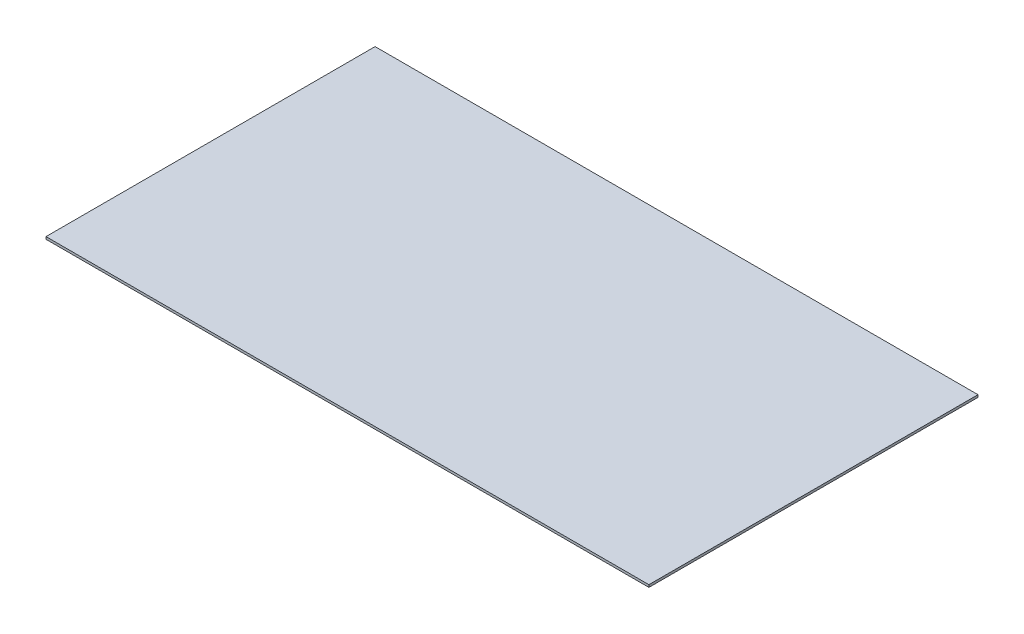
ISO-10303-21;
HEADER;
FILE_DESCRIPTION(('STEP AP214'),'2;1');
FILE_NAME('part.step','',(''),(''),'','','');
FILE_SCHEMA(('AUTOMOTIVE_DESIGN { 1 0 10303 214 1 1 1 1 }'));
ENDSEC;
DATA;
#1=APPLICATION_CONTEXT('core data for automotive mechanical design processes');
#2=APPLICATION_PROTOCOL_DEFINITION('international standard','automotive_design',2000,#1);
#3=PRODUCT_CONTEXT('',#1,'mechanical');
#4=PRODUCT('Part','Part','',(#3));
#5=PRODUCT_RELATED_PRODUCT_CATEGORY('part','',(#4));
#6=PRODUCT_DEFINITION_FORMATION('','',#4);
#7=PRODUCT_DEFINITION_CONTEXT('part definition',#1,'design');
#8=PRODUCT_DEFINITION('design','',#6,#7);
#9=PRODUCT_DEFINITION_SHAPE('','',#8);
#10=(LENGTH_UNIT() NAMED_UNIT(*) SI_UNIT(.MILLI.,.METRE.));
#11=(NAMED_UNIT(*) PLANE_ANGLE_UNIT() SI_UNIT($,.RADIAN.));
#12=(NAMED_UNIT(*) SI_UNIT($,.STERADIAN.) SOLID_ANGLE_UNIT());
#13=UNCERTAINTY_MEASURE_WITH_UNIT(LENGTH_MEASURE(1.E-05),#10,'distance_accuracy_value','');
#14=(GEOMETRIC_REPRESENTATION_CONTEXT(3) GLOBAL_UNCERTAINTY_ASSIGNED_CONTEXT((#13)) GLOBAL_UNIT_ASSIGNED_CONTEXT((#10,
#11,#12)) REPRESENTATION_CONTEXT('',''));
#15=CARTESIAN_POINT('',(0.,0.,0.));
#16=DIRECTION('',(0.,0.,1.));
#17=DIRECTION('',(1.,0.,0.));
#18=AXIS2_PLACEMENT_3D('',#15,#16,#17);
#19=CARTESIAN_POINT('',(0.,3.,0.));
#20=DIRECTION('',(1.,0.,0.));
#21=DIRECTION('',(0.,0.,-1.));
#22=AXIS2_PLACEMENT_3D('',#19,#20,#21);
#23=PLANE('',#22);
#24=DIRECTION('',(0.,0.,1.));
#25=VECTOR('',#24,1.);
#26=CARTESIAN_POINT('',(0.,0.,0.));
#27=LINE('',#26,#25);
#28=CARTESIAN_POINT('',(0.,0.,-415.925000000327));
#29=VERTEX_POINT('',#28);
#30=CARTESIAN_POINT('',(0.,0.,0.));
#31=VERTEX_POINT('',#30);
#32=EDGE_CURVE('E95',#29,#31,#27,.T.);
#33=ORIENTED_EDGE('',*,*,#32,.T.);
#34=DIRECTION('',(0.,-1.,0.));
#35=VECTOR('',#34,1.);
#36=CARTESIAN_POINT('',(0.,3.,0.));
#37=LINE('',#36,#35);
#38=CARTESIAN_POINT('',(0.,3.,0.));
#39=VERTEX_POINT('',#38);
#40=EDGE_CURVE('E11',#39,#31,#37,.T.);
#41=ORIENTED_EDGE('',*,*,#40,.F.);
#42=DIRECTION('',(0.,0.,1.));
#43=VECTOR('',#42,1.);
#44=CARTESIAN_POINT('',(0.,3.,0.));
#45=LINE('',#44,#43);
#46=CARTESIAN_POINT('',(0.,3.,-415.925000000327));
#47=VERTEX_POINT('',#46);
#48=EDGE_CURVE('E83',#47,#39,#45,.T.);
#49=ORIENTED_EDGE('',*,*,#48,.F.);
#50=DIRECTION('',(0.,-1.,0.));
#51=VECTOR('',#50,1.);
#52=CARTESIAN_POINT('',(0.,3.,-415.925000000327));
#53=LINE('',#52,#51);
#54=EDGE_CURVE('E91',#47,#29,#53,.T.);
#55=ORIENTED_EDGE('',*,*,#54,.T.);
#56=EDGE_LOOP('',(#33,#41,#49,#55));
#57=FACE_BOUND('',#56,.T.);
#58=ADVANCED_FACE('F32',(#57),#23,.F.);
#59=CARTESIAN_POINT('',(0.,3.,0.));
#60=DIRECTION('',(0.,0.,-1.));
#61=DIRECTION('',(-1.,0.,0.));
#62=AXIS2_PLACEMENT_3D('',#59,#60,#61);
#63=PLANE('',#62);
#64=DIRECTION('',(1.,0.,0.));
#65=VECTOR('',#64,1.);
#66=CARTESIAN_POINT('',(0.,0.,0.));
#67=LINE('',#66,#65);
#68=CARTESIAN_POINT('',(761.999999999997,0.,0.));
#69=VERTEX_POINT('',#68);
#70=EDGE_CURVE('E87',#31,#69,#67,.T.);
#71=ORIENTED_EDGE('',*,*,#70,.T.);
#72=DIRECTION('',(0.,-1.,0.));
#73=VECTOR('',#72,1.);
#74=CARTESIAN_POINT('',(761.999999999997,3.,0.));
#75=LINE('',#74,#73);
#76=CARTESIAN_POINT('',(761.999999999997,3.,0.));
#77=VERTEX_POINT('',#76);
#78=EDGE_CURVE('E40',#77,#69,#75,.T.);
#79=ORIENTED_EDGE('',*,*,#78,.F.);
#80=DIRECTION('',(1.,0.,0.));
#81=VECTOR('',#80,1.);
#82=CARTESIAN_POINT('',(0.,3.,0.));
#83=LINE('',#82,#81);
#84=EDGE_CURVE('E78',#39,#77,#83,.T.);
#85=ORIENTED_EDGE('',*,*,#84,.F.);
#86=ORIENTED_EDGE('',*,*,#40,.T.);
#87=EDGE_LOOP('',(#71,#79,#85,#86));
#88=FACE_BOUND('',#87,.T.);
#89=ADVANCED_FACE('F86',(#88),#63,.F.);
#90=CARTESIAN_POINT('',(761.999999999997,3.,0.));
#91=DIRECTION('',(-1.,0.,0.));
#92=DIRECTION('',(0.,0.,1.));
#93=AXIS2_PLACEMENT_3D('',#90,#91,#92);
#94=PLANE('',#93);
#95=DIRECTION('',(0.,0.,-1.));
#96=VECTOR('',#95,1.);
#97=CARTESIAN_POINT('',(761.999999999997,0.,0.));
#98=LINE('',#97,#96);
#99=CARTESIAN_POINT('',(761.999999999997,0.,-415.925000000327));
#100=VERTEX_POINT('',#99);
#101=EDGE_CURVE('E65',#69,#100,#98,.T.);
#102=ORIENTED_EDGE('',*,*,#101,.T.);
#103=DIRECTION('',(0.,-1.,0.));
#104=VECTOR('',#103,1.);
#105=CARTESIAN_POINT('',(761.999999999997,3.,-415.925000000327));
#106=LINE('',#105,#104);
#107=CARTESIAN_POINT('',(761.999999999997,3.,-415.925000000327));
#108=VERTEX_POINT('',#107);
#109=EDGE_CURVE('E88',#108,#100,#106,.T.);
#110=ORIENTED_EDGE('',*,*,#109,.F.);
#111=DIRECTION('',(0.,0.,-1.));
#112=VECTOR('',#111,1.);
#113=CARTESIAN_POINT('',(761.999999999997,3.,0.));
#114=LINE('',#113,#112);
#115=EDGE_CURVE('E81',#77,#108,#114,.T.);
#116=ORIENTED_EDGE('',*,*,#115,.F.);
#117=ORIENTED_EDGE('',*,*,#78,.T.);
#118=EDGE_LOOP('',(#102,#110,#116,#117));
#119=FACE_BOUND('',#118,.T.);
#120=ADVANCED_FACE('F89',(#119),#94,.F.);
#121=CARTESIAN_POINT('',(0.,3.,-415.925000000327));
#122=DIRECTION('',(0.,0.,1.));
#123=DIRECTION('',(1.,0.,0.));
#124=AXIS2_PLACEMENT_3D('',#121,#122,#123);
#125=PLANE('',#124);
#126=DIRECTION('',(-1.,0.,0.));
#127=VECTOR('',#126,1.);
#128=CARTESIAN_POINT('',(0.,0.,-415.925000000327));
#129=LINE('',#128,#127);
#130=EDGE_CURVE('E71',#100,#29,#129,.T.);
#131=ORIENTED_EDGE('',*,*,#130,.T.);
#132=ORIENTED_EDGE('',*,*,#54,.F.);
#133=DIRECTION('',(-1.,0.,0.));
#134=VECTOR('',#133,1.);
#135=CARTESIAN_POINT('',(0.,3.,-415.925000000327));
#136=LINE('',#135,#134);
#137=EDGE_CURVE('E48',#108,#47,#136,.T.);
#138=ORIENTED_EDGE('',*,*,#137,.F.);
#139=ORIENTED_EDGE('',*,*,#109,.T.);
#140=EDGE_LOOP('',(#131,#132,#138,#139));
#141=FACE_BOUND('',#140,.T.);
#142=ADVANCED_FACE('F102',(#141),#125,.F.);
#143=CARTESIAN_POINT('',(0.,3.,0.));
#144=DIRECTION('',(0.,-1.,0.));
#145=DIRECTION('',(0.,0.,-1.));
#146=AXIS2_PLACEMENT_3D('',#143,#144,#145);
#147=PLANE('',#146);
#148=ORIENTED_EDGE('',*,*,#48,.T.);
#149=ORIENTED_EDGE('',*,*,#84,.T.);
#150=ORIENTED_EDGE('',*,*,#115,.T.);
#151=ORIENTED_EDGE('',*,*,#137,.T.);
#152=EDGE_LOOP('',(#148,#149,#150,#151));
#153=FACE_BOUND('',#152,.T.);
#154=ADVANCED_FACE('F79',(#153),#147,.F.);
#155=CARTESIAN_POINT('',(0.,0.,0.));
#156=DIRECTION('',(0.,-1.,0.));
#157=DIRECTION('',(0.,0.,-1.));
#158=AXIS2_PLACEMENT_3D('',#155,#156,#157);
#159=PLANE('',#158);
#160=ORIENTED_EDGE('',*,*,#32,.F.);
#161=ORIENTED_EDGE('',*,*,#130,.F.);
#162=ORIENTED_EDGE('',*,*,#101,.F.);
#163=ORIENTED_EDGE('',*,*,#70,.F.);
#164=EDGE_LOOP('',(#160,#161,#162,#163));
#165=FACE_BOUND('',#164,.T.);
#166=ADVANCED_FACE('F105',(#165),#159,.T.);
#167=CLOSED_SHELL('',(#58,#89,#120,#142,#154,#166));
#168=MANIFOLD_SOLID_BREP('B2',#167);
#169=ADVANCED_BREP_SHAPE_REPRESENTATION('',(#18,#168),#14);
#170=SHAPE_DEFINITION_REPRESENTATION(#9,#169);
ENDSEC;
END-ISO-10303-21;
